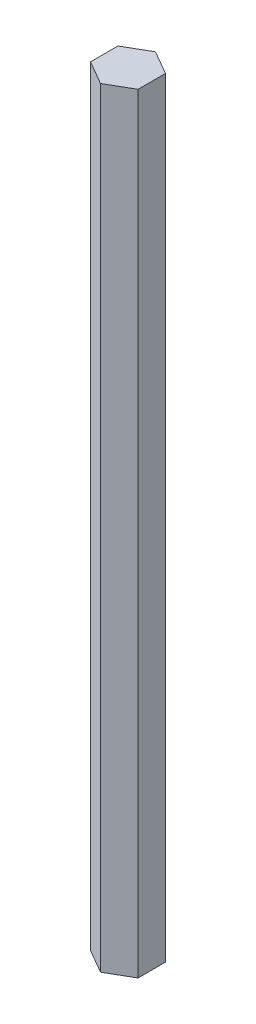
ISO-10303-21;
HEADER;
FILE_DESCRIPTION(('STEP AP214'),'2;1');
FILE_NAME('part.step','',(''),(''),'','','');
FILE_SCHEMA(('AUTOMOTIVE_DESIGN { 1 0 10303 214 1 1 1 1 }'));
ENDSEC;
DATA;
#1=APPLICATION_CONTEXT('core data for automotive mechanical design processes');
#2=APPLICATION_PROTOCOL_DEFINITION('international standard','automotive_design',2000,#1);
#3=PRODUCT_CONTEXT('',#1,'mechanical');
#4=PRODUCT('Part','Part','',(#3));
#5=PRODUCT_RELATED_PRODUCT_CATEGORY('part','',(#4));
#6=PRODUCT_DEFINITION_FORMATION('','',#4);
#7=PRODUCT_DEFINITION_CONTEXT('part definition',#1,'design');
#8=PRODUCT_DEFINITION('design','',#6,#7);
#9=PRODUCT_DEFINITION_SHAPE('','',#8);
#10=(LENGTH_UNIT() NAMED_UNIT(*) SI_UNIT(.MILLI.,.METRE.));
#11=(NAMED_UNIT(*) PLANE_ANGLE_UNIT() SI_UNIT($,.RADIAN.));
#12=(NAMED_UNIT(*) SI_UNIT($,.STERADIAN.) SOLID_ANGLE_UNIT());
#13=UNCERTAINTY_MEASURE_WITH_UNIT(LENGTH_MEASURE(1.E-05),#10,'distance_accuracy_value','');
#14=(GEOMETRIC_REPRESENTATION_CONTEXT(3) GLOBAL_UNCERTAINTY_ASSIGNED_CONTEXT((#13)) GLOBAL_UNIT_ASSIGNED_CONTEXT((#10,
#11,#12)) REPRESENTATION_CONTEXT('',''));
#15=CARTESIAN_POINT('',(0.,0.,0.));
#16=DIRECTION('',(0.,0.,1.));
#17=DIRECTION('',(1.,0.,0.));
#18=AXIS2_PLACEMENT_3D('',#15,#16,#17);
#19=CARTESIAN_POINT('',(-2.63964543073497,170.92422,-4.572));
#20=DIRECTION('',(0.5,0.,0.866025403784439));
#21=DIRECTION('',(0.866025403784439,0.,-0.5));
#22=AXIS2_PLACEMENT_3D('',#19,#20,#21);
#23=PLANE('',#22);
#24=DIRECTION('',(-0.866025403784439,0.,0.5));
#25=VECTOR('',#24,1.);
#26=CARTESIAN_POINT('',(-2.63964543073497,0.,-4.572));
#27=LINE('',#26,#25);
#28=CARTESIAN_POINT('',(0.,0.,-6.096));
#29=VERTEX_POINT('',#28);
#30=CARTESIAN_POINT('',(-5.27929086146994,0.,-3.048));
#31=VERTEX_POINT('',#30);
#32=EDGE_CURVE('E118',#29,#31,#27,.T.);
#33=ORIENTED_EDGE('',*,*,#32,.T.);
#34=DIRECTION('',(0.,-1.,0.));
#35=VECTOR('',#34,1.);
#36=CARTESIAN_POINT('',(-5.27929086146994,170.92422,-3.048));
#37=LINE('',#36,#35);
#38=CARTESIAN_POINT('',(-5.27929086146994,170.92422,-3.048));
#39=VERTEX_POINT('',#38);
#40=EDGE_CURVE('E11',#39,#31,#37,.T.);
#41=ORIENTED_EDGE('',*,*,#40,.F.);
#42=DIRECTION('',(-0.866025403784439,0.,0.5));
#43=VECTOR('',#42,1.);
#44=CARTESIAN_POINT('',(-2.63964543073497,170.92422,-4.572));
#45=LINE('',#44,#43);
#46=CARTESIAN_POINT('',(0.,170.92422,-6.096));
#47=VERTEX_POINT('',#46);
#48=EDGE_CURVE('E128',#47,#39,#45,.T.);
#49=ORIENTED_EDGE('',*,*,#48,.F.);
#50=DIRECTION('',(0.,-1.,0.));
#51=VECTOR('',#50,1.);
#52=CARTESIAN_POINT('',(0.,170.92422,-6.096));
#53=LINE('',#52,#51);
#54=EDGE_CURVE('E114',#47,#29,#53,.T.);
#55=ORIENTED_EDGE('',*,*,#54,.T.);
#56=EDGE_LOOP('',(#33,#41,#49,#55));
#57=FACE_BOUND('',#56,.T.);
#58=ADVANCED_FACE('F34',(#57),#23,.F.);
#59=CARTESIAN_POINT('',(-5.27929086146994,170.92422,0.));
#60=DIRECTION('',(1.,0.,0.));
#61=DIRECTION('',(0.,0.,-1.));
#62=AXIS2_PLACEMENT_3D('',#59,#60,#61);
#63=PLANE('',#62);
#64=DIRECTION('',(0.,0.,1.));
#65=VECTOR('',#64,1.);
#66=CARTESIAN_POINT('',(-5.27929086146994,0.,0.));
#67=LINE('',#66,#65);
#68=CARTESIAN_POINT('',(-5.27929086146994,0.,3.048));
#69=VERTEX_POINT('',#68);
#70=EDGE_CURVE('E121',#31,#69,#67,.T.);
#71=ORIENTED_EDGE('',*,*,#70,.T.);
#72=DIRECTION('',(0.,-1.,0.));
#73=VECTOR('',#72,1.);
#74=CARTESIAN_POINT('',(-5.27929086146994,170.92422,3.048));
#75=LINE('',#74,#73);
#76=CARTESIAN_POINT('',(-5.27929086146994,170.92422,3.048));
#77=VERTEX_POINT('',#76);
#78=EDGE_CURVE('E42',#77,#69,#75,.T.);
#79=ORIENTED_EDGE('',*,*,#78,.F.);
#80=DIRECTION('',(0.,0.,1.));
#81=VECTOR('',#80,1.);
#82=CARTESIAN_POINT('',(-5.27929086146994,170.92422,0.));
#83=LINE('',#82,#81);
#84=EDGE_CURVE('E87',#39,#77,#83,.T.);
#85=ORIENTED_EDGE('',*,*,#84,.F.);
#86=ORIENTED_EDGE('',*,*,#40,.T.);
#87=EDGE_LOOP('',(#71,#79,#85,#86));
#88=FACE_BOUND('',#87,.T.);
#89=ADVANCED_FACE('F152',(#88),#63,.F.);
#90=CARTESIAN_POINT('',(-2.63964543073497,170.92422,4.572));
#91=DIRECTION('',(0.5,0.,-0.866025403784439));
#92=DIRECTION('',(-0.866025403784439,0.,-0.5));
#93=AXIS2_PLACEMENT_3D('',#90,#91,#92);
#94=PLANE('',#93);
#95=DIRECTION('',(0.866025403784439,0.,0.5));
#96=VECTOR('',#95,1.);
#97=CARTESIAN_POINT('',(-2.63964543073497,0.,4.572));
#98=LINE('',#97,#96);
#99=CARTESIAN_POINT('',(0.,0.,6.096));
#100=VERTEX_POINT('',#99);
#101=EDGE_CURVE('E123',#69,#100,#98,.T.);
#102=ORIENTED_EDGE('',*,*,#101,.T.);
#103=DIRECTION('',(0.,-1.,0.));
#104=VECTOR('',#103,1.);
#105=CARTESIAN_POINT('',(0.,170.92422,6.096));
#106=LINE('',#105,#104);
#107=CARTESIAN_POINT('',(0.,170.92422,6.096));
#108=VERTEX_POINT('',#107);
#109=EDGE_CURVE('E109',#108,#100,#106,.T.);
#110=ORIENTED_EDGE('',*,*,#109,.F.);
#111=DIRECTION('',(0.866025403784439,0.,0.5));
#112=VECTOR('',#111,1.);
#113=CARTESIAN_POINT('',(-2.63964543073497,170.92422,4.572));
#114=LINE('',#113,#112);
#115=EDGE_CURVE('E100',#77,#108,#114,.T.);
#116=ORIENTED_EDGE('',*,*,#115,.F.);
#117=ORIENTED_EDGE('',*,*,#78,.T.);
#118=EDGE_LOOP('',(#102,#110,#116,#117));
#119=FACE_BOUND('',#118,.T.);
#120=ADVANCED_FACE('F134',(#119),#94,.F.);
#121=CARTESIAN_POINT('',(2.63964543073497,170.92422,4.572));
#122=DIRECTION('',(-0.5,0.,-0.866025403784438));
#123=DIRECTION('',(-0.866025403784439,0.,0.5));
#124=AXIS2_PLACEMENT_3D('',#121,#122,#123);
#125=PLANE('',#124);
#126=DIRECTION('',(0.866025403784439,0.,-0.5));
#127=VECTOR('',#126,1.);
#128=CARTESIAN_POINT('',(2.63964543073497,0.,4.572));
#129=LINE('',#128,#127);
#130=CARTESIAN_POINT('',(5.27929086146994,0.,3.048));
#131=VERTEX_POINT('',#130);
#132=EDGE_CURVE('E108',#100,#131,#129,.T.);
#133=ORIENTED_EDGE('',*,*,#132,.T.);
#134=DIRECTION('',(0.,-1.,0.));
#135=VECTOR('',#134,1.);
#136=CARTESIAN_POINT('',(5.27929086146994,170.92422,3.048));
#137=LINE('',#136,#135);
#138=CARTESIAN_POINT('',(5.27929086146994,170.92422,3.048));
#139=VERTEX_POINT('',#138);
#140=EDGE_CURVE('E105',#139,#131,#137,.T.);
#141=ORIENTED_EDGE('',*,*,#140,.F.);
#142=DIRECTION('',(0.866025403784439,0.,-0.5));
#143=VECTOR('',#142,1.);
#144=CARTESIAN_POINT('',(2.63964543073497,170.92422,4.572));
#145=LINE('',#144,#143);
#146=EDGE_CURVE('E94',#108,#139,#145,.T.);
#147=ORIENTED_EDGE('',*,*,#146,.F.);
#148=ORIENTED_EDGE('',*,*,#109,.T.);
#149=EDGE_LOOP('',(#133,#141,#147,#148));
#150=FACE_BOUND('',#149,.T.);
#151=ADVANCED_FACE('F106',(#150),#125,.F.);
#152=CARTESIAN_POINT('',(5.27929086146994,170.92422,0.));
#153=DIRECTION('',(-1.,0.,0.));
#154=DIRECTION('',(0.,0.,1.));
#155=AXIS2_PLACEMENT_3D('',#152,#153,#154);
#156=PLANE('',#155);
#157=DIRECTION('',(0.,0.,-1.));
#158=VECTOR('',#157,1.);
#159=CARTESIAN_POINT('',(5.27929086146994,0.,0.));
#160=LINE('',#159,#158);
#161=CARTESIAN_POINT('',(5.27929086146994,0.,-3.048));
#162=VERTEX_POINT('',#161);
#163=EDGE_CURVE('E73',#131,#162,#160,.T.);
#164=ORIENTED_EDGE('',*,*,#163,.T.);
#165=DIRECTION('',(0.,-1.,0.));
#166=VECTOR('',#165,1.);
#167=CARTESIAN_POINT('',(5.27929086146994,170.92422,-3.048));
#168=LINE('',#167,#166);
#169=CARTESIAN_POINT('',(5.27929086146994,170.92422,-3.048));
#170=VERTEX_POINT('',#169);
#171=EDGE_CURVE('E110',#170,#162,#168,.T.);
#172=ORIENTED_EDGE('',*,*,#171,.F.);
#173=DIRECTION('',(0.,0.,-1.));
#174=VECTOR('',#173,1.);
#175=CARTESIAN_POINT('',(5.27929086146994,170.92422,0.));
#176=LINE('',#175,#174);
#177=EDGE_CURVE('E98',#139,#170,#176,.T.);
#178=ORIENTED_EDGE('',*,*,#177,.F.);
#179=ORIENTED_EDGE('',*,*,#140,.T.);
#180=EDGE_LOOP('',(#164,#172,#178,#179));
#181=FACE_BOUND('',#180,.T.);
#182=ADVANCED_FACE('F112',(#181),#156,.F.);
#183=CARTESIAN_POINT('',(2.63964543073497,170.92422,-4.572));
#184=DIRECTION('',(-0.5,0.,0.866025403784439));
#185=DIRECTION('',(0.866025403784439,0.,0.5));
#186=AXIS2_PLACEMENT_3D('',#183,#184,#185);
#187=PLANE('',#186);
#188=DIRECTION('',(-0.866025403784439,0.,-0.5));
#189=VECTOR('',#188,1.);
#190=CARTESIAN_POINT('',(2.63964543073497,0.,-4.572));
#191=LINE('',#190,#189);
#192=EDGE_CURVE('E79',#162,#29,#191,.T.);
#193=ORIENTED_EDGE('',*,*,#192,.T.);
#194=ORIENTED_EDGE('',*,*,#54,.F.);
#195=DIRECTION('',(-0.866025403784439,0.,-0.5));
#196=VECTOR('',#195,1.);
#197=CARTESIAN_POINT('',(2.63964543073497,170.92422,-4.572));
#198=LINE('',#197,#196);
#199=EDGE_CURVE('E50',#170,#47,#198,.T.);
#200=ORIENTED_EDGE('',*,*,#199,.F.);
#201=ORIENTED_EDGE('',*,*,#171,.T.);
#202=EDGE_LOOP('',(#193,#194,#200,#201));
#203=FACE_BOUND('',#202,.T.);
#204=ADVANCED_FACE('F141',(#203),#187,.F.);
#205=CARTESIAN_POINT('',(0.,170.92422,0.));
#206=DIRECTION('',(0.,1.,0.));
#207=DIRECTION('',(0.,0.,1.));
#208=AXIS2_PLACEMENT_3D('',#205,#206,#207);
#209=PLANE('',#208);
#210=ORIENTED_EDGE('',*,*,#48,.T.);
#211=ORIENTED_EDGE('',*,*,#84,.T.);
#212=ORIENTED_EDGE('',*,*,#115,.T.);
#213=ORIENTED_EDGE('',*,*,#146,.T.);
#214=ORIENTED_EDGE('',*,*,#177,.T.);
#215=ORIENTED_EDGE('',*,*,#199,.T.);
#216=EDGE_LOOP('',(#210,#211,#212,#213,#214,#215));
#217=FACE_BOUND('',#216,.T.);
#218=ADVANCED_FACE('F96',(#217),#209,.T.);
#219=CARTESIAN_POINT('',(0.,0.,0.));
#220=DIRECTION('',(0.,1.,0.));
#221=DIRECTION('',(0.,0.,1.));
#222=AXIS2_PLACEMENT_3D('',#219,#220,#221);
#223=PLANE('',#222);
#224=ORIENTED_EDGE('',*,*,#32,.F.);
#225=ORIENTED_EDGE('',*,*,#192,.F.);
#226=ORIENTED_EDGE('',*,*,#163,.F.);
#227=ORIENTED_EDGE('',*,*,#132,.F.);
#228=ORIENTED_EDGE('',*,*,#101,.F.);
#229=ORIENTED_EDGE('',*,*,#70,.F.);
#230=EDGE_LOOP('',(#224,#225,#226,#227,#228,#229));
#231=FACE_BOUND('',#230,.T.);
#232=ADVANCED_FACE('F137',(#231),#223,.F.);
#233=CLOSED_SHELL('',(#58,#89,#120,#151,#182,#204,#218,#232));
#234=MANIFOLD_SOLID_BREP('B2',#233);
#235=ADVANCED_BREP_SHAPE_REPRESENTATION('',(#18,#234),#14);
#236=SHAPE_DEFINITION_REPRESENTATION(#9,#235);
ENDSEC;
END-ISO-10303-21;
